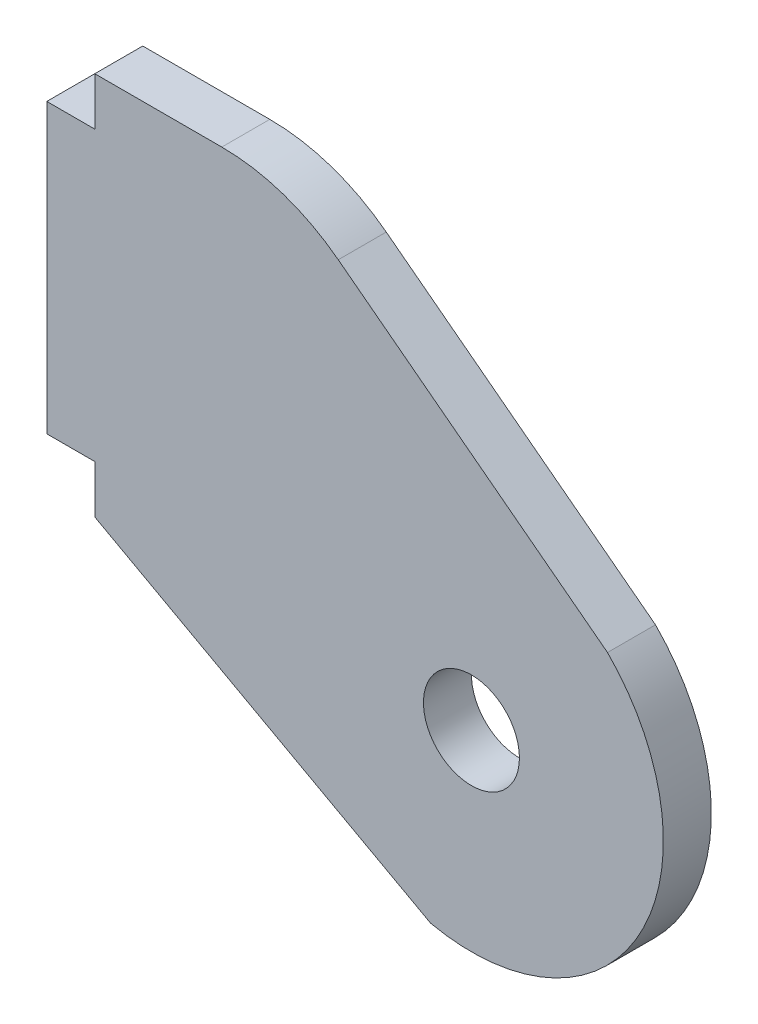
ISO-10303-21;
HEADER;
FILE_DESCRIPTION(('STEP AP214'),'2;1');
FILE_NAME('part.step','',(''),(''),'','','');
FILE_SCHEMA(('AUTOMOTIVE_DESIGN { 1 0 10303 214 1 1 1 1 }'));
ENDSEC;
DATA;
#1=APPLICATION_CONTEXT('core data for automotive mechanical design processes');
#2=APPLICATION_PROTOCOL_DEFINITION('international standard','automotive_design',2000,#1);
#3=PRODUCT_CONTEXT('',#1,'mechanical');
#4=PRODUCT('Part','Part','',(#3));
#5=PRODUCT_RELATED_PRODUCT_CATEGORY('part','',(#4));
#6=PRODUCT_DEFINITION_FORMATION('','',#4);
#7=PRODUCT_DEFINITION_CONTEXT('part definition',#1,'design');
#8=PRODUCT_DEFINITION('design','',#6,#7);
#9=PRODUCT_DEFINITION_SHAPE('','',#8);
#10=(LENGTH_UNIT() NAMED_UNIT(*) SI_UNIT(.MILLI.,.METRE.));
#11=(NAMED_UNIT(*) PLANE_ANGLE_UNIT() SI_UNIT($,.RADIAN.));
#12=(NAMED_UNIT(*) SI_UNIT($,.STERADIAN.) SOLID_ANGLE_UNIT());
#13=UNCERTAINTY_MEASURE_WITH_UNIT(LENGTH_MEASURE(1.E-05),#10,'distance_accuracy_value','');
#14=(GEOMETRIC_REPRESENTATION_CONTEXT(3) GLOBAL_UNCERTAINTY_ASSIGNED_CONTEXT((#13)) GLOBAL_UNIT_ASSIGNED_CONTEXT((#10,
#11,#12)) REPRESENTATION_CONTEXT('',''));
#15=CARTESIAN_POINT('',(0.,0.,0.));
#16=DIRECTION('',(0.,0.,1.));
#17=DIRECTION('',(1.,0.,0.));
#18=AXIS2_PLACEMENT_3D('',#15,#16,#17);
#19=CARTESIAN_POINT('',(427.91942335712,0.,3.175));
#20=DIRECTION('',(1.,0.,0.));
#21=DIRECTION('',(0.,0.,-1.));
#22=AXIS2_PLACEMENT_3D('',#19,#20,#21);
#23=PLANE('',#22);
#24=DIRECTION('',(0.,-1.,0.));
#25=VECTOR('',#24,1.);
#26=CARTESIAN_POINT('',(427.91942335712,0.,0.));
#27=LINE('',#26,#25);
#28=CARTESIAN_POINT('',(427.91942335712,0.,0.));
#29=VERTEX_POINT('',#28);
#30=CARTESIAN_POINT('',(427.91942335712,-3.17499999999997,0.));
#31=VERTEX_POINT('',#30);
#32=EDGE_CURVE('E135',#29,#31,#27,.T.);
#33=ORIENTED_EDGE('',*,*,#32,.T.);
#34=DIRECTION('',(0.,0.,-1.));
#35=VECTOR('',#34,1.);
#36=CARTESIAN_POINT('',(427.91942335712,-3.17499999999997,3.175));
#37=LINE('',#36,#35);
#38=CARTESIAN_POINT('',(427.91942335712,-3.17499999999997,3.175));
#39=VERTEX_POINT('',#38);
#40=EDGE_CURVE('E116',#39,#31,#37,.T.);
#41=ORIENTED_EDGE('',*,*,#40,.F.);
#42=DIRECTION('',(0.,-1.,0.));
#43=VECTOR('',#42,1.);
#44=CARTESIAN_POINT('',(427.91942335712,0.,3.175));
#45=LINE('',#44,#43);
#46=CARTESIAN_POINT('',(427.91942335712,0.,3.175));
#47=VERTEX_POINT('',#46);
#48=EDGE_CURVE('E123',#47,#39,#45,.T.);
#49=ORIENTED_EDGE('',*,*,#48,.F.);
#50=DIRECTION('',(0.,0.,-1.));
#51=VECTOR('',#50,1.);
#52=CARTESIAN_POINT('',(427.91942335712,0.,3.175));
#53=LINE('',#52,#51);
#54=EDGE_CURVE('E158',#47,#29,#53,.T.);
#55=ORIENTED_EDGE('',*,*,#54,.T.);
#56=EDGE_LOOP('',(#33,#41,#49,#55));
#57=FACE_BOUND('',#56,.T.);
#58=ADVANCED_FACE('F35',(#57),#23,.F.);
#59=CARTESIAN_POINT('',(424.74442335712,-3.17499999999998,3.175));
#60=DIRECTION('',(0.,-1.,0.));
#61=DIRECTION('',(1.,0.,0.));
#62=AXIS2_PLACEMENT_3D('',#59,#60,#61);
#63=PLANE('',#62);
#64=DIRECTION('',(-1.,0.,0.));
#65=VECTOR('',#64,1.);
#66=CARTESIAN_POINT('',(424.74442335712,-3.17499999999998,0.));
#67=LINE('',#66,#65);
#68=CARTESIAN_POINT('',(424.74442335712,-3.17499999999998,0.));
#69=VERTEX_POINT('',#68);
#70=EDGE_CURVE('E173',#31,#69,#67,.T.);
#71=ORIENTED_EDGE('',*,*,#70,.T.);
#72=DIRECTION('',(0.,0.,-1.));
#73=VECTOR('',#72,1.);
#74=CARTESIAN_POINT('',(424.74442335712,-3.17499999999998,3.175));
#75=LINE('',#74,#73);
#76=CARTESIAN_POINT('',(424.74442335712,-3.17499999999998,3.175));
#77=VERTEX_POINT('',#76);
#78=EDGE_CURVE('E119',#77,#69,#75,.T.);
#79=ORIENTED_EDGE('',*,*,#78,.F.);
#80=DIRECTION('',(-1.,0.,0.));
#81=VECTOR('',#80,1.);
#82=CARTESIAN_POINT('',(424.74442335712,-3.17499999999998,3.175));
#83=LINE('',#82,#81);
#84=EDGE_CURVE('E112',#39,#77,#83,.T.);
#85=ORIENTED_EDGE('',*,*,#84,.F.);
#86=ORIENTED_EDGE('',*,*,#40,.T.);
#87=EDGE_LOOP('',(#71,#79,#85,#86));
#88=FACE_BOUND('',#87,.T.);
#89=ADVANCED_FACE('F114',(#88),#63,.F.);
#90=CARTESIAN_POINT('',(424.74442335712,-22.225,3.175));
#91=DIRECTION('',(1.,0.,0.));
#92=DIRECTION('',(0.,0.,-1.));
#93=AXIS2_PLACEMENT_3D('',#90,#91,#92);
#94=PLANE('',#93);
#95=DIRECTION('',(0.,-1.,0.));
#96=VECTOR('',#95,1.);
#97=CARTESIAN_POINT('',(424.74442335712,-22.225,0.));
#98=LINE('',#97,#96);
#99=CARTESIAN_POINT('',(424.74442335712,-22.225,0.));
#100=VERTEX_POINT('',#99);
#101=EDGE_CURVE('E171',#69,#100,#98,.T.);
#102=ORIENTED_EDGE('',*,*,#101,.T.);
#103=DIRECTION('',(0.,0.,-1.));
#104=VECTOR('',#103,1.);
#105=CARTESIAN_POINT('',(424.74442335712,-22.225,3.175));
#106=LINE('',#105,#104);
#107=CARTESIAN_POINT('',(424.74442335712,-22.225,3.175));
#108=VERTEX_POINT('',#107);
#109=EDGE_CURVE('E140',#108,#100,#106,.T.);
#110=ORIENTED_EDGE('',*,*,#109,.F.);
#111=DIRECTION('',(0.,-1.,0.));
#112=VECTOR('',#111,1.);
#113=CARTESIAN_POINT('',(424.74442335712,-22.225,3.175));
#114=LINE('',#113,#112);
#115=EDGE_CURVE('E122',#77,#108,#114,.T.);
#116=ORIENTED_EDGE('',*,*,#115,.F.);
#117=ORIENTED_EDGE('',*,*,#78,.T.);
#118=EDGE_LOOP('',(#102,#110,#116,#117));
#119=FACE_BOUND('',#118,.T.);
#120=ADVANCED_FACE('F216',(#119),#94,.F.);
#121=CARTESIAN_POINT('',(427.91942335712,-22.225,3.175));
#122=DIRECTION('',(0.,1.,0.));
#123=DIRECTION('',(-1.,0.,0.));
#124=AXIS2_PLACEMENT_3D('',#121,#122,#123);
#125=PLANE('',#124);
#126=DIRECTION('',(1.,0.,0.));
#127=VECTOR('',#126,1.);
#128=CARTESIAN_POINT('',(427.91942335712,-22.225,0.));
#129=LINE('',#128,#127);
#130=CARTESIAN_POINT('',(427.91942335712,-22.225,0.));
#131=VERTEX_POINT('',#130);
#132=EDGE_CURVE('E169',#100,#131,#129,.T.);
#133=ORIENTED_EDGE('',*,*,#132,.T.);
#134=DIRECTION('',(0.,0.,-1.));
#135=VECTOR('',#134,1.);
#136=CARTESIAN_POINT('',(427.91942335712,-22.225,3.175));
#137=LINE('',#136,#135);
#138=CARTESIAN_POINT('',(427.91942335712,-22.225,3.175));
#139=VERTEX_POINT('',#138);
#140=EDGE_CURVE('E146',#139,#131,#137,.T.);
#141=ORIENTED_EDGE('',*,*,#140,.F.);
#142=DIRECTION('',(1.,0.,0.));
#143=VECTOR('',#142,1.);
#144=CARTESIAN_POINT('',(427.91942335712,-22.225,3.175));
#145=LINE('',#144,#143);
#146=EDGE_CURVE('E186',#108,#139,#145,.T.);
#147=ORIENTED_EDGE('',*,*,#146,.F.);
#148=ORIENTED_EDGE('',*,*,#109,.T.);
#149=EDGE_LOOP('',(#133,#141,#147,#148));
#150=FACE_BOUND('',#149,.T.);
#151=ADVANCED_FACE('F221',(#150),#125,.F.);
#152=CARTESIAN_POINT('',(427.91942335712,-22.225,3.175));
#153=DIRECTION('',(1.,0.,0.));
#154=DIRECTION('',(0.,0.,-1.));
#155=AXIS2_PLACEMENT_3D('',#152,#153,#154);
#156=PLANE('',#155);
#157=DIRECTION('',(0.,-1.,0.));
#158=VECTOR('',#157,1.);
#159=CARTESIAN_POINT('',(427.91942335712,-22.225,0.));
#160=LINE('',#159,#158);
#161=CARTESIAN_POINT('',(427.91942335712,-25.3999999999999,0.));
#162=VERTEX_POINT('',#161);
#163=EDGE_CURVE('E167',#131,#162,#160,.T.);
#164=ORIENTED_EDGE('',*,*,#163,.T.);
#165=DIRECTION('',(0.,0.,-1.));
#166=VECTOR('',#165,1.);
#167=CARTESIAN_POINT('',(427.91942335712,-25.3999999999999,3.175));
#168=LINE('',#167,#166);
#169=CARTESIAN_POINT('',(427.91942335712,-25.3999999999999,3.175));
#170=VERTEX_POINT('',#169);
#171=EDGE_CURVE('E149',#170,#162,#168,.T.);
#172=ORIENTED_EDGE('',*,*,#171,.F.);
#173=DIRECTION('',(0.,-1.,0.));
#174=VECTOR('',#173,1.);
#175=CARTESIAN_POINT('',(427.91942335712,-22.225,3.175));
#176=LINE('',#175,#174);
#177=EDGE_CURVE('E184',#139,#170,#176,.T.);
#178=ORIENTED_EDGE('',*,*,#177,.F.);
#179=ORIENTED_EDGE('',*,*,#140,.T.);
#180=EDGE_LOOP('',(#164,#172,#178,#179));
#181=FACE_BOUND('',#180,.T.);
#182=ADVANCED_FACE('F225',(#181),#156,.F.);
#183=CARTESIAN_POINT('',(427.91942335712,-25.3999999999999,3.175));
#184=DIRECTION('',(0.480325676751226,0.87709021443263,0.));
#185=DIRECTION('',(-0.87709021443263,0.480325676751226,0.));
#186=AXIS2_PLACEMENT_3D('',#183,#184,#185);
#187=PLANE('',#186);
#188=DIRECTION('',(0.87709021443263,-0.480325676751225,0.));
#189=VECTOR('',#188,1.);
#190=CARTESIAN_POINT('',(427.91942335712,-25.3999999999999,0.));
#191=LINE('',#190,#189);
#192=CARTESIAN_POINT('',(450.14442335712,-37.5711974322978,0.));
#193=VERTEX_POINT('',#192);
#194=EDGE_CURVE('E165',#162,#193,#191,.T.);
#195=ORIENTED_EDGE('',*,*,#194,.T.);
#196=DIRECTION('',(0.,0.,-1.));
#197=VECTOR('',#196,1.);
#198=CARTESIAN_POINT('',(450.14442335712,-37.5711974322978,3.175));
#199=LINE('',#198,#197);
#200=CARTESIAN_POINT('',(450.14442335712,-37.5711974322978,3.175));
#201=VERTEX_POINT('',#200);
#202=EDGE_CURVE('E152',#201,#193,#199,.T.);
#203=ORIENTED_EDGE('',*,*,#202,.F.);
#204=DIRECTION('',(0.87709021443263,-0.480325676751225,0.));
#205=VECTOR('',#204,1.);
#206=CARTESIAN_POINT('',(427.91942335712,-25.3999999999999,3.175));
#207=LINE('',#206,#205);
#208=EDGE_CURVE('E182',#170,#201,#207,.T.);
#209=ORIENTED_EDGE('',*,*,#208,.F.);
#210=ORIENTED_EDGE('',*,*,#171,.T.);
#211=EDGE_LOOP('',(#195,#203,#209,#210));
#212=FACE_BOUND('',#211,.T.);
#213=ADVANCED_FACE('F229',(#212),#187,.F.);
#214=CARTESIAN_POINT('',(452.84317335712,-25.1612518869902,3.175));
#215=DIRECTION('',(0.,0.,-1.));
#216=DIRECTION('',(-1.,0.,0.));
#217=AXIS2_PLACEMENT_3D('',#214,#215,#216);
#218=CYLINDRICAL_SURFACE('',#217,12.7);
#219=CARTESIAN_POINT('',(452.84317335712,-25.1612518869902,0.));
#220=DIRECTION('',(0.,0.,1.));
#221=DIRECTION('',(1.,0.,0.));
#222=AXIS2_PLACEMENT_3D('',#219,#220,#221);
#223=CIRCLE('',#222,12.7);
#224=CARTESIAN_POINT('',(461.846041333275,-16.2036647004802,0.));
#225=VERTEX_POINT('',#224);
#226=EDGE_CURVE('E163',#193,#225,#223,.T.);
#227=ORIENTED_EDGE('',*,*,#226,.T.);
#228=DIRECTION('',(0.,0.,-1.));
#229=VECTOR('',#228,1.);
#230=CARTESIAN_POINT('',(461.846041333275,-16.2036647004802,3.175));
#231=LINE('',#230,#229);
#232=CARTESIAN_POINT('',(461.846041333275,-16.2036647004802,3.175));
#233=VERTEX_POINT('',#232);
#234=EDGE_CURVE('E155',#233,#225,#231,.T.);
#235=ORIENTED_EDGE('',*,*,#234,.F.);
#236=CARTESIAN_POINT('',(452.84317335712,-25.1612518869902,3.175));
#237=DIRECTION('',(0.,0.,1.));
#238=DIRECTION('',(1.,0.,0.));
#239=AXIS2_PLACEMENT_3D('',#236,#237,#238);
#240=CIRCLE('',#239,12.7);
#241=EDGE_CURVE('E180',#201,#233,#240,.T.);
#242=ORIENTED_EDGE('',*,*,#241,.F.);
#243=ORIENTED_EDGE('',*,*,#202,.T.);
#244=EDGE_LOOP('',(#227,#235,#242,#243));
#245=FACE_BOUND('',#244,.T.);
#246=ADVANCED_FACE('F233',(#245),#218,.T.);
#247=CARTESIAN_POINT('',(440.61942335712,0.,3.175));
#248=DIRECTION('',(-0.606777523421596,-0.794871711076923,0.));
#249=DIRECTION('',(0.794871711076923,-0.606777523421596,0.));
#250=AXIS2_PLACEMENT_3D('',#247,#248,#249);
#251=PLANE('',#250);
#252=DIRECTION('',(-0.794871711076923,0.606777523421596,0.));
#253=VECTOR('',#252,1.);
#254=CARTESIAN_POINT('',(440.61942335712,0.,0.));
#255=LINE('',#254,#253);
#256=CARTESIAN_POINT('',(444.03211331341,-2.60512926932308,0.));
#257=VERTEX_POINT('',#256);
#258=EDGE_CURVE('E161',#225,#257,#255,.T.);
#259=ORIENTED_EDGE('',*,*,#258,.T.);
#260=DIRECTION('',(0.,0.,-1.));
#261=VECTOR('',#260,1.);
#262=CARTESIAN_POINT('',(444.03211331341,-2.60512926932308,3.175));
#263=LINE('',#262,#261);
#264=CARTESIAN_POINT('',(444.03211331341,-2.60512926932308,3.175));
#265=VERTEX_POINT('',#264);
#266=EDGE_CURVE('E43',#257,#265,#263,.F.);
#267=ORIENTED_EDGE('',*,*,#266,.T.);
#268=DIRECTION('',(-0.794871711076923,0.606777523421596,0.));
#269=VECTOR('',#268,1.);
#270=CARTESIAN_POINT('',(440.61942335712,0.,3.175));
#271=LINE('',#270,#269);
#272=EDGE_CURVE('E178',#233,#265,#271,.T.);
#273=ORIENTED_EDGE('',*,*,#272,.F.);
#274=ORIENTED_EDGE('',*,*,#234,.T.);
#275=EDGE_LOOP('',(#259,#267,#273,#274));
#276=FACE_BOUND('',#275,.T.);
#277=ADVANCED_FACE('F208',(#276),#251,.F.);
#278=CARTESIAN_POINT('',(427.91942335712,0.,3.175));
#279=DIRECTION('',(0.,-1.,0.));
#280=DIRECTION('',(0.,0.,-1.));
#281=AXIS2_PLACEMENT_3D('',#278,#279,#280);
#282=PLANE('',#281);
#283=DIRECTION('',(-1.,0.,0.));
#284=VECTOR('',#283,1.);
#285=CARTESIAN_POINT('',(427.91942335712,0.,3.175));
#286=LINE('',#285,#284);
#287=CARTESIAN_POINT('',(436.326038765956,0.,3.175));
#288=VERTEX_POINT('',#287);
#289=EDGE_CURVE('E128',#288,#47,#286,.T.);
#290=ORIENTED_EDGE('',*,*,#289,.F.);
#291=DIRECTION('',(0.,0.,-1.));
#292=VECTOR('',#291,1.);
#293=CARTESIAN_POINT('',(436.326038765956,0.,3.175));
#294=LINE('',#293,#292);
#295=CARTESIAN_POINT('',(436.326038765956,0.,0.));
#296=VERTEX_POINT('',#295);
#297=EDGE_CURVE('E136',#288,#296,#294,.T.);
#298=ORIENTED_EDGE('',*,*,#297,.T.);
#299=DIRECTION('',(-1.,0.,0.));
#300=VECTOR('',#299,1.);
#301=CARTESIAN_POINT('',(427.91942335712,0.,0.));
#302=LINE('',#301,#300);
#303=EDGE_CURVE('E132',#296,#29,#302,.T.);
#304=ORIENTED_EDGE('',*,*,#303,.T.);
#305=ORIENTED_EDGE('',*,*,#54,.F.);
#306=EDGE_LOOP('',(#290,#298,#304,#305));
#307=FACE_BOUND('',#306,.T.);
#308=ADVANCED_FACE('F200',(#307),#282,.F.);
#309=CARTESIAN_POINT('',(452.84317335712,-25.1612518869902,3.175));
#310=DIRECTION('',(0.,0.,1.));
#311=DIRECTION('',(1.,0.,0.));
#312=AXIS2_PLACEMENT_3D('',#309,#310,#311);
#313=PLANE('',#312);
#314=CARTESIAN_POINT('',(452.84317335712,-25.1612518869902,3.175));
#315=DIRECTION('',(0.,0.,1.));
#316=DIRECTION('',(1.,0.,0.));
#317=AXIS2_PLACEMENT_3D('',#314,#315,#316);
#318=CIRCLE('',#317,3.17499999999998);
#319=CARTESIAN_POINT('',(456.01817335712,-25.1612518869902,3.175));
#320=VERTEX_POINT('',#319);
#321=EDGE_CURVE('E191',#320,#320,#318,.T.);
#322=ORIENTED_EDGE('',*,*,#321,.F.);
#323=EDGE_LOOP('',(#322));
#324=FACE_BOUND('',#323,.T.);
#325=ORIENTED_EDGE('',*,*,#272,.T.);
#326=CARTESIAN_POINT('',(436.326038765956,-12.7,3.175));
#327=DIRECTION('',(0.,0.,1.));
#328=DIRECTION('',(1.,0.,0.));
#329=AXIS2_PLACEMENT_3D('',#326,#327,#328);
#330=CIRCLE('',#329,12.7);
#331=EDGE_CURVE('E11',#265,#288,#330,.T.);
#332=ORIENTED_EDGE('',*,*,#331,.T.);
#333=ORIENTED_EDGE('',*,*,#289,.T.);
#334=ORIENTED_EDGE('',*,*,#48,.T.);
#335=ORIENTED_EDGE('',*,*,#84,.T.);
#336=ORIENTED_EDGE('',*,*,#115,.T.);
#337=ORIENTED_EDGE('',*,*,#146,.T.);
#338=ORIENTED_EDGE('',*,*,#177,.T.);
#339=ORIENTED_EDGE('',*,*,#208,.T.);
#340=ORIENTED_EDGE('',*,*,#241,.T.);
#341=EDGE_LOOP('',(#325,#332,#333,#334,#335,#336,#337,#338,#339,#340));
#342=FACE_BOUND('',#341,.T.);
#343=ADVANCED_FACE('F126',(#324,#342),#313,.T.);
#344=CARTESIAN_POINT('',(452.84317335712,-25.1612518869902,0.));
#345=DIRECTION('',(0.,0.,1.));
#346=DIRECTION('',(1.,0.,0.));
#347=AXIS2_PLACEMENT_3D('',#344,#345,#346);
#348=PLANE('',#347);
#349=CARTESIAN_POINT('',(452.84317335712,-25.1612518869902,0.));
#350=DIRECTION('',(0.,0.,1.));
#351=DIRECTION('',(1.,0.,0.));
#352=AXIS2_PLACEMENT_3D('',#349,#350,#351);
#353=CIRCLE('',#352,3.17499999999998);
#354=CARTESIAN_POINT('',(456.01817335712,-25.1612518869902,0.));
#355=VERTEX_POINT('',#354);
#356=EDGE_CURVE('E176',#355,#355,#353,.T.);
#357=ORIENTED_EDGE('',*,*,#356,.T.);
#358=EDGE_LOOP('',(#357));
#359=FACE_BOUND('',#358,.T.);
#360=ORIENTED_EDGE('',*,*,#303,.F.);
#361=CARTESIAN_POINT('',(436.326038765956,-12.7,0.));
#362=DIRECTION('',(0.,0.,1.));
#363=DIRECTION('',(1.,0.,0.));
#364=AXIS2_PLACEMENT_3D('',#361,#362,#363);
#365=CIRCLE('',#364,12.7);
#366=EDGE_CURVE('E57',#296,#257,#365,.F.);
#367=ORIENTED_EDGE('',*,*,#366,.T.);
#368=ORIENTED_EDGE('',*,*,#258,.F.);
#369=ORIENTED_EDGE('',*,*,#226,.F.);
#370=ORIENTED_EDGE('',*,*,#194,.F.);
#371=ORIENTED_EDGE('',*,*,#163,.F.);
#372=ORIENTED_EDGE('',*,*,#132,.F.);
#373=ORIENTED_EDGE('',*,*,#101,.F.);
#374=ORIENTED_EDGE('',*,*,#70,.F.);
#375=ORIENTED_EDGE('',*,*,#32,.F.);
#376=EDGE_LOOP('',(#360,#367,#368,#369,#370,#371,#372,#373,#374,#375));
#377=FACE_BOUND('',#376,.T.);
#378=ADVANCED_FACE('F199',(#359,#377),#348,.F.);
#379=CARTESIAN_POINT('',(452.84317335712,-25.1612518869902,3.175));
#380=DIRECTION('',(0.,0.,1.));
#381=DIRECTION('',(1.,0.,0.));
#382=AXIS2_PLACEMENT_3D('',#379,#380,#381);
#383=CYLINDRICAL_SURFACE('',#382,3.17499999999998);
#384=ORIENTED_EDGE('',*,*,#321,.T.);
#385=EDGE_LOOP('',(#384));
#386=FACE_BOUND('',#385,.T.);
#387=ORIENTED_EDGE('',*,*,#356,.F.);
#388=EDGE_LOOP('',(#387));
#389=FACE_BOUND('',#388,.T.);
#390=ADVANCED_FACE('F195',(#386,#389),#383,.F.);
#391=CARTESIAN_POINT('',(436.326038765956,-12.7,3.175));
#392=DIRECTION('',(0.,0.,-1.));
#393=DIRECTION('',(-1.,0.,0.));
#394=AXIS2_PLACEMENT_3D('',#391,#392,#393);
#395=CYLINDRICAL_SURFACE('',#394,12.7);
#396=ORIENTED_EDGE('',*,*,#331,.F.);
#397=ORIENTED_EDGE('',*,*,#266,.F.);
#398=ORIENTED_EDGE('',*,*,#366,.F.);
#399=ORIENTED_EDGE('',*,*,#297,.F.);
#400=EDGE_LOOP('',(#396,#397,#398,#399));
#401=FACE_BOUND('',#400,.T.);
#402=ADVANCED_FACE('F37',(#401),#395,.T.);
#403=CLOSED_SHELL('',(#58,#89,#120,#151,#182,#213,#246,#277,#308,#343,#378,#390,#402));
#404=MANIFOLD_SOLID_BREP('B2',#403);
#405=ADVANCED_BREP_SHAPE_REPRESENTATION('',(#18,#404),#14);
#406=SHAPE_DEFINITION_REPRESENTATION(#9,#405);
ENDSEC;
END-ISO-10303-21;
